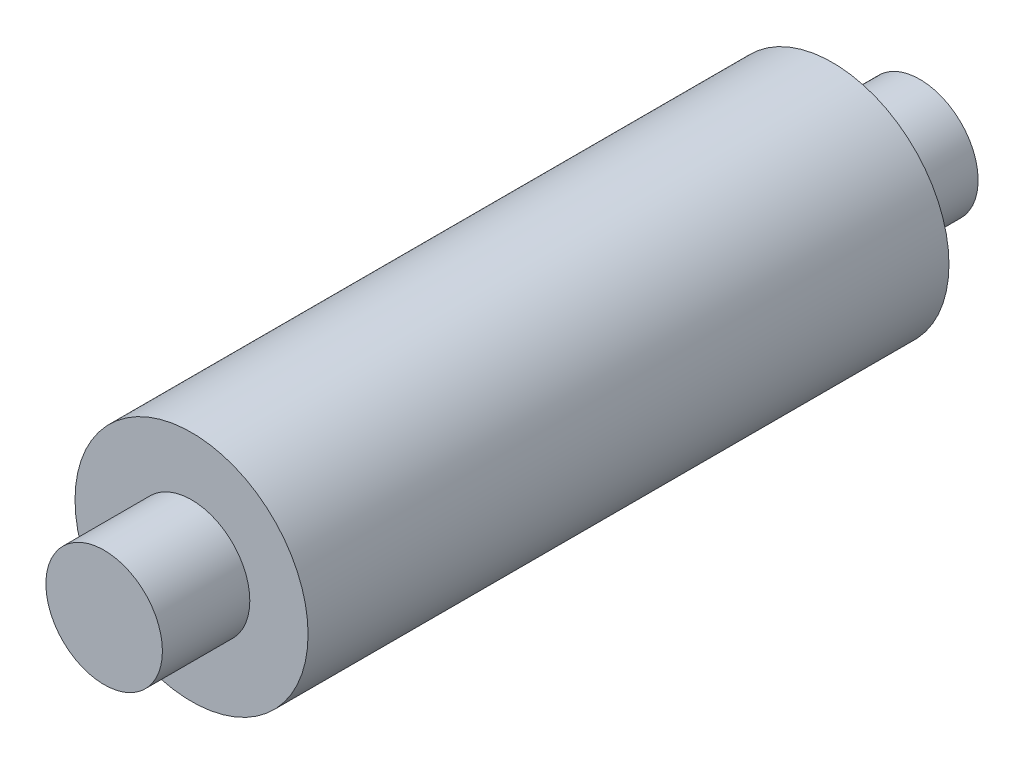
ISO-10303-21;
HEADER;
FILE_DESCRIPTION(('STEP AP214'),'2;1');
FILE_NAME('part.step','',(''),(''),'','','');
FILE_SCHEMA(('AUTOMOTIVE_DESIGN { 1 0 10303 214 1 1 1 1 }'));
ENDSEC;
DATA;
#1=APPLICATION_CONTEXT('core data for automotive mechanical design processes');
#2=APPLICATION_PROTOCOL_DEFINITION('international standard','automotive_design',2000,#1);
#3=PRODUCT_CONTEXT('',#1,'mechanical');
#4=PRODUCT('Part','Part','',(#3));
#5=PRODUCT_RELATED_PRODUCT_CATEGORY('part','',(#4));
#6=PRODUCT_DEFINITION_FORMATION('','',#4);
#7=PRODUCT_DEFINITION_CONTEXT('part definition',#1,'design');
#8=PRODUCT_DEFINITION('design','',#6,#7);
#9=PRODUCT_DEFINITION_SHAPE('','',#8);
#10=(LENGTH_UNIT() NAMED_UNIT(*) SI_UNIT(.MILLI.,.METRE.));
#11=(NAMED_UNIT(*) PLANE_ANGLE_UNIT() SI_UNIT($,.RADIAN.));
#12=(NAMED_UNIT(*) SI_UNIT($,.STERADIAN.) SOLID_ANGLE_UNIT());
#13=UNCERTAINTY_MEASURE_WITH_UNIT(LENGTH_MEASURE(1.E-05),#10,'distance_accuracy_value','');
#14=(GEOMETRIC_REPRESENTATION_CONTEXT(3) GLOBAL_UNCERTAINTY_ASSIGNED_CONTEXT((#13)) GLOBAL_UNIT_ASSIGNED_CONTEXT((#10,
#11,#12)) REPRESENTATION_CONTEXT('',''));
#15=CARTESIAN_POINT('',(0.,0.,0.));
#16=DIRECTION('',(0.,0.,1.));
#17=DIRECTION('',(1.,0.,0.));
#18=AXIS2_PLACEMENT_3D('',#15,#16,#17);
#19=CARTESIAN_POINT('',(0.,0.,11.));
#20=DIRECTION('',(0.,0.,-1.));
#21=DIRECTION('',(-1.,0.,0.));
#22=AXIS2_PLACEMENT_3D('',#19,#20,#21);
#23=CYLINDRICAL_SURFACE('',#22,2.);
#24=CARTESIAN_POINT('',(0.,0.,11.));
#25=DIRECTION('',(0.,0.,1.));
#26=DIRECTION('',(1.,0.,0.));
#27=AXIS2_PLACEMENT_3D('',#24,#25,#26);
#28=CIRCLE('',#27,2.);
#29=CARTESIAN_POINT('',(2.,0.,11.));
#30=VERTEX_POINT('',#29);
#31=EDGE_CURVE('E55',#30,#30,#28,.T.);
#32=ORIENTED_EDGE('',*,*,#31,.F.);
#33=EDGE_LOOP('',(#32));
#34=FACE_BOUND('',#33,.T.);
#35=CARTESIAN_POINT('',(0.,0.,0.));
#36=DIRECTION('',(0.,0.,1.));
#37=DIRECTION('',(1.,0.,0.));
#38=AXIS2_PLACEMENT_3D('',#35,#36,#37);
#39=CIRCLE('',#38,2.);
#40=CARTESIAN_POINT('',(2.,0.,0.));
#41=VERTEX_POINT('',#40);
#42=EDGE_CURVE('E44',#41,#41,#39,.T.);
#43=ORIENTED_EDGE('',*,*,#42,.T.);
#44=EDGE_LOOP('',(#43));
#45=FACE_BOUND('',#44,.T.);
#46=ADVANCED_FACE('F41',(#34,#45),#23,.T.);
#47=CARTESIAN_POINT('',(0.,0.,11.));
#48=DIRECTION('',(0.,0.,1.));
#49=DIRECTION('',(1.,0.,0.));
#50=AXIS2_PLACEMENT_3D('',#47,#48,#49);
#51=PLANE('',#50);
#52=CARTESIAN_POINT('',(0.,0.,11.));
#53=DIRECTION('',(0.,0.,1.));
#54=DIRECTION('',(1.,0.,0.));
#55=AXIS2_PLACEMENT_3D('',#52,#53,#54);
#56=CIRCLE('',#55,1.);
#57=CARTESIAN_POINT('',(1.,0.,11.));
#58=VERTEX_POINT('',#57);
#59=EDGE_CURVE('E49',#58,#58,#56,.T.);
#60=ORIENTED_EDGE('',*,*,#59,.F.);
#61=EDGE_LOOP('',(#60));
#62=FACE_BOUND('',#61,.T.);
#63=ORIENTED_EDGE('',*,*,#31,.T.);
#64=EDGE_LOOP('',(#63));
#65=FACE_BOUND('',#64,.T.);
#66=ADVANCED_FACE('F75',(#62,#65),#51,.T.);
#67=CARTESIAN_POINT('',(0.,0.,0.));
#68=DIRECTION('',(0.,0.,1.));
#69=DIRECTION('',(1.,0.,0.));
#70=AXIS2_PLACEMENT_3D('',#67,#68,#69);
#71=PLANE('',#70);
#72=CARTESIAN_POINT('',(0.,0.,0.));
#73=DIRECTION('',(0.,0.,-1.));
#74=DIRECTION('',(-1.,0.,0.));
#75=AXIS2_PLACEMENT_3D('',#72,#73,#74);
#76=CIRCLE('',#75,1.);
#77=CARTESIAN_POINT('',(-1.,0.,0.));
#78=VERTEX_POINT('',#77);
#79=EDGE_CURVE('E10',#78,#78,#76,.T.);
#80=ORIENTED_EDGE('',*,*,#79,.F.);
#81=EDGE_LOOP('',(#80));
#82=FACE_BOUND('',#81,.T.);
#83=ORIENTED_EDGE('',*,*,#42,.F.);
#84=EDGE_LOOP('',(#83));
#85=FACE_BOUND('',#84,.T.);
#86=ADVANCED_FACE('F72',(#82,#85),#71,.F.);
#87=CARTESIAN_POINT('',(0.,0.,12.5));
#88=DIRECTION('',(0.,0.,-1.));
#89=DIRECTION('',(-1.,0.,0.));
#90=AXIS2_PLACEMENT_3D('',#87,#88,#89);
#91=CYLINDRICAL_SURFACE('',#90,1.);
#92=CARTESIAN_POINT('',(0.,0.,12.5));
#93=DIRECTION('',(0.,0.,1.));
#94=DIRECTION('',(1.,0.,0.));
#95=AXIS2_PLACEMENT_3D('',#92,#93,#94);
#96=CIRCLE('',#95,1.);
#97=CARTESIAN_POINT('',(1.,0.,12.5));
#98=VERTEX_POINT('',#97);
#99=EDGE_CURVE('E60',#98,#98,#96,.T.);
#100=ORIENTED_EDGE('',*,*,#99,.F.);
#101=EDGE_LOOP('',(#100));
#102=FACE_BOUND('',#101,.T.);
#103=ORIENTED_EDGE('',*,*,#59,.T.);
#104=EDGE_LOOP('',(#103));
#105=FACE_BOUND('',#104,.T.);
#106=ADVANCED_FACE('F74',(#102,#105),#91,.T.);
#107=CARTESIAN_POINT('',(0.,0.,12.5));
#108=DIRECTION('',(0.,0.,1.));
#109=DIRECTION('',(1.,0.,0.));
#110=AXIS2_PLACEMENT_3D('',#107,#108,#109);
#111=PLANE('',#110);
#112=ORIENTED_EDGE('',*,*,#99,.T.);
#113=EDGE_LOOP('',(#112));
#114=FACE_BOUND('',#113,.T.);
#115=ADVANCED_FACE('F81',(#114),#111,.T.);
#116=CARTESIAN_POINT('',(0.,0.,-1.5));
#117=DIRECTION('',(0.,0.,1.));
#118=DIRECTION('',(1.,0.,0.));
#119=AXIS2_PLACEMENT_3D('',#116,#117,#118);
#120=CYLINDRICAL_SURFACE('',#119,1.);
#121=CARTESIAN_POINT('',(0.,0.,-1.5));
#122=DIRECTION('',(0.,0.,-1.));
#123=DIRECTION('',(-1.,0.,0.));
#124=AXIS2_PLACEMENT_3D('',#121,#122,#123);
#125=CIRCLE('',#124,1.);
#126=CARTESIAN_POINT('',(-1.,0.,-1.5));
#127=VERTEX_POINT('',#126);
#128=EDGE_CURVE('E59',#127,#127,#125,.T.);
#129=ORIENTED_EDGE('',*,*,#128,.F.);
#130=EDGE_LOOP('',(#129));
#131=FACE_BOUND('',#130,.T.);
#132=ORIENTED_EDGE('',*,*,#79,.T.);
#133=EDGE_LOOP('',(#132));
#134=FACE_BOUND('',#133,.T.);
#135=ADVANCED_FACE('F111',(#131,#134),#120,.T.);
#136=CARTESIAN_POINT('',(0.,0.,-1.5));
#137=DIRECTION('',(0.,0.,-1.));
#138=DIRECTION('',(-1.,0.,0.));
#139=AXIS2_PLACEMENT_3D('',#136,#137,#138);
#140=PLANE('',#139);
#141=ORIENTED_EDGE('',*,*,#128,.T.);
#142=EDGE_LOOP('',(#141));
#143=FACE_BOUND('',#142,.T.);
#144=ADVANCED_FACE('F127',(#143),#140,.T.);
#145=CLOSED_SHELL('',(#46,#66,#86,#106,#115,#135,#144));
#146=MANIFOLD_SOLID_BREP('B2',#145);
#147=ADVANCED_BREP_SHAPE_REPRESENTATION('',(#18,#146),#14);
#148=SHAPE_DEFINITION_REPRESENTATION(#9,#147);
ENDSEC;
END-ISO-10303-21;
